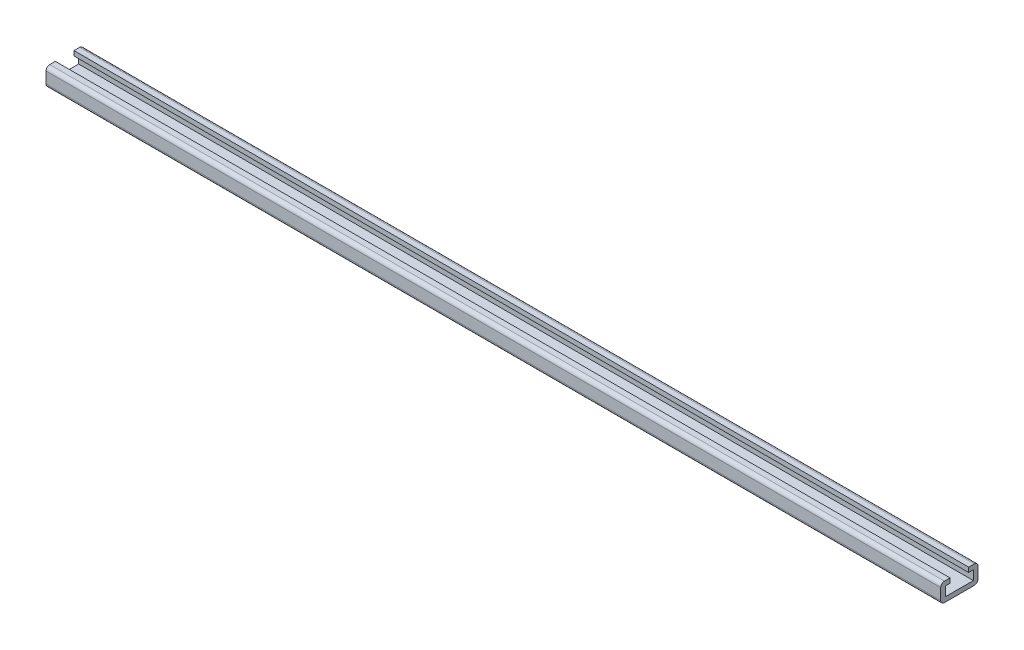
ISO-10303-21;
HEADER;
FILE_DESCRIPTION(('STEP AP214'),'2;1');
FILE_NAME('part.step','',(''),(''),'','','');
FILE_SCHEMA(('AUTOMOTIVE_DESIGN { 1 0 10303 214 1 1 1 1 }'));
ENDSEC;
DATA;
#1=APPLICATION_CONTEXT('core data for automotive mechanical design processes');
#2=APPLICATION_PROTOCOL_DEFINITION('international standard','automotive_design',2000,#1);
#3=PRODUCT_CONTEXT('',#1,'mechanical');
#4=PRODUCT('Part','Part','',(#3));
#5=PRODUCT_RELATED_PRODUCT_CATEGORY('part','',(#4));
#6=PRODUCT_DEFINITION_FORMATION('','',#4);
#7=PRODUCT_DEFINITION_CONTEXT('part definition',#1,'design');
#8=PRODUCT_DEFINITION('design','',#6,#7);
#9=PRODUCT_DEFINITION_SHAPE('','',#8);
#10=(LENGTH_UNIT() NAMED_UNIT(*) SI_UNIT(.MILLI.,.METRE.));
#11=(NAMED_UNIT(*) PLANE_ANGLE_UNIT() SI_UNIT($,.RADIAN.));
#12=(NAMED_UNIT(*) SI_UNIT($,.STERADIAN.) SOLID_ANGLE_UNIT());
#13=UNCERTAINTY_MEASURE_WITH_UNIT(LENGTH_MEASURE(1.E-05),#10,'distance_accuracy_value','');
#14=(GEOMETRIC_REPRESENTATION_CONTEXT(3) GLOBAL_UNCERTAINTY_ASSIGNED_CONTEXT((#13)) GLOBAL_UNIT_ASSIGNED_CONTEXT((#10,
#11,#12)) REPRESENTATION_CONTEXT('',''));
#15=CARTESIAN_POINT('',(0.,0.,0.));
#16=DIRECTION('',(0.,0.,1.));
#17=DIRECTION('',(1.,0.,0.));
#18=AXIS2_PLACEMENT_3D('',#15,#16,#17);
#19=CARTESIAN_POINT('',(609.6,3.175,9.525));
#20=DIRECTION('',(0.,-1.,0.));
#21=DIRECTION('',(0.,0.,-1.));
#22=AXIS2_PLACEMENT_3D('',#19,#20,#21);
#23=PLANE('',#22);
#24=CARTESIAN_POINT('',(25.4,3.175,0.));
#25=DIRECTION('',(0.,1.,0.));
#26=DIRECTION('',(0.,0.,1.));
#27=AXIS2_PLACEMENT_3D('',#24,#25,#26);
#28=CIRCLE('',#27,3.2639);
#29=CARTESIAN_POINT('',(25.4,3.175,3.2639));
#30=VERTEX_POINT('',#29);
#31=EDGE_CURVE('E388',#30,#30,#28,.T.);
#32=ORIENTED_EDGE('',*,*,#31,.F.);
#33=EDGE_LOOP('',(#32));
#34=FACE_BOUND('',#33,.T.);
#35=CARTESIAN_POINT('',(533.4,3.175,0.));
#36=DIRECTION('',(0.,1.,0.));
#37=DIRECTION('',(0.,0.,1.));
#38=AXIS2_PLACEMENT_3D('',#35,#36,#37);
#39=CIRCLE('',#38,3.26389999999999);
#40=CARTESIAN_POINT('',(533.4,3.175,3.26389999999999));
#41=VERTEX_POINT('',#40);
#42=EDGE_CURVE('E380',#41,#41,#39,.T.);
#43=ORIENTED_EDGE('',*,*,#42,.F.);
#44=EDGE_LOOP('',(#43));
#45=FACE_BOUND('',#44,.T.);
#46=DIRECTION('',(0.,0.,1.));
#47=VECTOR('',#46,1.);
#48=CARTESIAN_POINT('',(0.,3.175,9.525));
#49=LINE('',#48,#47);
#50=CARTESIAN_POINT('',(0.,3.175,-9.525));
#51=VERTEX_POINT('',#50);
#52=CARTESIAN_POINT('',(0.,3.175,9.525));
#53=VERTEX_POINT('',#52);
#54=EDGE_CURVE('E165',#51,#53,#49,.T.);
#55=ORIENTED_EDGE('',*,*,#54,.T.);
#56=DIRECTION('',(-1.,0.,0.));
#57=VECTOR('',#56,1.);
#58=CARTESIAN_POINT('',(609.6,3.175,9.525));
#59=LINE('',#58,#57);
#60=CARTESIAN_POINT('',(609.6,3.175,9.525));
#61=VERTEX_POINT('',#60);
#62=EDGE_CURVE('E272',#61,#53,#59,.T.);
#63=ORIENTED_EDGE('',*,*,#62,.F.);
#64=DIRECTION('',(0.,0.,1.));
#65=VECTOR('',#64,1.);
#66=CARTESIAN_POINT('',(609.6,3.175,9.525));
#67=LINE('',#66,#65);
#68=CARTESIAN_POINT('',(609.6,3.175,-9.525));
#69=VERTEX_POINT('',#68);
#70=EDGE_CURVE('E216',#69,#61,#67,.T.);
#71=ORIENTED_EDGE('',*,*,#70,.F.);
#72=DIRECTION('',(-1.,0.,0.));
#73=VECTOR('',#72,1.);
#74=CARTESIAN_POINT('',(609.6,3.175,-9.525));
#75=LINE('',#74,#73);
#76=EDGE_CURVE('E189',#69,#51,#75,.T.);
#77=ORIENTED_EDGE('',*,*,#76,.T.);
#78=EDGE_LOOP('',(#55,#63,#71,#77));
#79=FACE_BOUND('',#78,.T.);
#80=ADVANCED_FACE('F38',(#34,#45,#79),#23,.F.);
#81=CARTESIAN_POINT('',(609.6,9.525,9.525));
#82=DIRECTION('',(0.,0.,1.));
#83=DIRECTION('',(1.,0.,0.));
#84=AXIS2_PLACEMENT_3D('',#81,#82,#83);
#85=PLANE('',#84);
#86=DIRECTION('',(0.,1.,0.));
#87=VECTOR('',#86,1.);
#88=CARTESIAN_POINT('',(0.,9.525,9.525));
#89=LINE('',#88,#87);
#90=CARTESIAN_POINT('',(0.,9.525,9.525));
#91=VERTEX_POINT('',#90);
#92=EDGE_CURVE('E242',#53,#91,#89,.T.);
#93=ORIENTED_EDGE('',*,*,#92,.T.);
#94=DIRECTION('',(-1.,0.,0.));
#95=VECTOR('',#94,1.);
#96=CARTESIAN_POINT('',(609.6,9.525,9.525));
#97=LINE('',#96,#95);
#98=CARTESIAN_POINT('',(609.6,9.525,9.525));
#99=VERTEX_POINT('',#98);
#100=EDGE_CURVE('E268',#99,#91,#97,.T.);
#101=ORIENTED_EDGE('',*,*,#100,.F.);
#102=DIRECTION('',(0.,1.,0.));
#103=VECTOR('',#102,1.);
#104=CARTESIAN_POINT('',(609.6,9.525,9.525));
#105=LINE('',#104,#103);
#106=EDGE_CURVE('E219',#61,#99,#105,.T.);
#107=ORIENTED_EDGE('',*,*,#106,.F.);
#108=ORIENTED_EDGE('',*,*,#62,.T.);
#109=EDGE_LOOP('',(#93,#101,#107,#108));
#110=FACE_BOUND('',#109,.T.);
#111=ADVANCED_FACE('F340',(#110),#85,.F.);
#112=CARTESIAN_POINT('',(609.6,9.525,6.35));
#113=DIRECTION('',(0.,1.,0.));
#114=DIRECTION('',(0.,0.,1.));
#115=AXIS2_PLACEMENT_3D('',#112,#113,#114);
#116=PLANE('',#115);
#117=DIRECTION('',(0.,0.,-1.));
#118=VECTOR('',#117,1.);
#119=CARTESIAN_POINT('',(0.,9.525,6.35));
#120=LINE('',#119,#118);
#121=CARTESIAN_POINT('',(0.,9.525,6.35));
#122=VERTEX_POINT('',#121);
#123=EDGE_CURVE('E245',#91,#122,#120,.T.);
#124=ORIENTED_EDGE('',*,*,#123,.T.);
#125=DIRECTION('',(-1.,0.,0.));
#126=VECTOR('',#125,1.);
#127=CARTESIAN_POINT('',(609.6,9.525,6.35));
#128=LINE('',#127,#126);
#129=CARTESIAN_POINT('',(609.6,9.525,6.35));
#130=VERTEX_POINT('',#129);
#131=EDGE_CURVE('E264',#130,#122,#128,.T.);
#132=ORIENTED_EDGE('',*,*,#131,.F.);
#133=DIRECTION('',(0.,0.,-1.));
#134=VECTOR('',#133,1.);
#135=CARTESIAN_POINT('',(609.6,9.525,6.35));
#136=LINE('',#135,#134);
#137=EDGE_CURVE('E223',#99,#130,#136,.T.);
#138=ORIENTED_EDGE('',*,*,#137,.F.);
#139=ORIENTED_EDGE('',*,*,#100,.T.);
#140=EDGE_LOOP('',(#124,#132,#138,#139));
#141=FACE_BOUND('',#140,.T.);
#142=ADVANCED_FACE('F344',(#141),#116,.F.);
#143=CARTESIAN_POINT('',(609.6,12.7,6.35));
#144=DIRECTION('',(0.,0.,1.));
#145=DIRECTION('',(1.,0.,0.));
#146=AXIS2_PLACEMENT_3D('',#143,#144,#145);
#147=PLANE('',#146);
#148=DIRECTION('',(0.,1.,0.));
#149=VECTOR('',#148,1.);
#150=CARTESIAN_POINT('',(0.,12.7,6.35));
#151=LINE('',#150,#149);
#152=CARTESIAN_POINT('',(0.,12.7,6.35));
#153=VERTEX_POINT('',#152);
#154=EDGE_CURVE('E248',#122,#153,#151,.T.);
#155=ORIENTED_EDGE('',*,*,#154,.T.);
#156=DIRECTION('',(-1.,0.,0.));
#157=VECTOR('',#156,1.);
#158=CARTESIAN_POINT('',(609.6,12.7,6.35));
#159=LINE('',#158,#157);
#160=CARTESIAN_POINT('',(609.6,12.7,6.35));
#161=VERTEX_POINT('',#160);
#162=EDGE_CURVE('E239',#161,#153,#159,.T.);
#163=ORIENTED_EDGE('',*,*,#162,.F.);
#164=DIRECTION('',(0.,1.,0.));
#165=VECTOR('',#164,1.);
#166=CARTESIAN_POINT('',(609.6,12.7,6.35));
#167=LINE('',#166,#165);
#168=EDGE_CURVE('E226',#130,#161,#167,.T.);
#169=ORIENTED_EDGE('',*,*,#168,.F.);
#170=ORIENTED_EDGE('',*,*,#131,.T.);
#171=EDGE_LOOP('',(#155,#163,#169,#170));
#172=FACE_BOUND('',#171,.T.);
#173=ADVANCED_FACE('F349',(#172),#147,.F.);
#174=CARTESIAN_POINT('',(609.6,12.7,12.7));
#175=DIRECTION('',(0.,-1.,0.));
#176=DIRECTION('',(0.,0.,-1.));
#177=AXIS2_PLACEMENT_3D('',#174,#175,#176);
#178=PLANE('',#177);
#179=DIRECTION('',(0.,0.,1.));
#180=VECTOR('',#179,1.);
#181=CARTESIAN_POINT('',(0.,12.7,12.7));
#182=LINE('',#181,#180);
#183=CARTESIAN_POINT('',(0.,12.7,10.16));
#184=VERTEX_POINT('',#183);
#185=EDGE_CURVE('E251',#153,#184,#182,.T.);
#186=ORIENTED_EDGE('',*,*,#185,.T.);
#187=DIRECTION('',(-1.,0.,0.));
#188=VECTOR('',#187,1.);
#189=CARTESIAN_POINT('',(609.6,12.7,10.16));
#190=LINE('',#189,#188);
#191=CARTESIAN_POINT('',(609.6,12.7,10.16));
#192=VERTEX_POINT('',#191);
#193=EDGE_CURVE('E11',#184,#192,#190,.F.);
#194=ORIENTED_EDGE('',*,*,#193,.T.);
#195=DIRECTION('',(0.,0.,1.));
#196=VECTOR('',#195,1.);
#197=CARTESIAN_POINT('',(609.6,12.7,12.7));
#198=LINE('',#197,#196);
#199=EDGE_CURVE('E229',#161,#192,#198,.T.);
#200=ORIENTED_EDGE('',*,*,#199,.F.);
#201=ORIENTED_EDGE('',*,*,#162,.T.);
#202=EDGE_LOOP('',(#186,#194,#200,#201));
#203=FACE_BOUND('',#202,.T.);
#204=ADVANCED_FACE('F416',(#203),#178,.F.);
#205=CARTESIAN_POINT('',(609.6,0.,12.7));
#206=DIRECTION('',(0.,0.,-1.));
#207=DIRECTION('',(-1.,0.,0.));
#208=AXIS2_PLACEMENT_3D('',#205,#206,#207);
#209=PLANE('',#208);
#210=DIRECTION('',(0.,-1.,0.));
#211=VECTOR('',#210,1.);
#212=CARTESIAN_POINT('',(0.,0.,12.7));
#213=LINE('',#212,#211);
#214=CARTESIAN_POINT('',(0.,10.16,12.7));
#215=VERTEX_POINT('',#214);
#216=CARTESIAN_POINT('',(0.,2.54,12.7));
#217=VERTEX_POINT('',#216);
#218=EDGE_CURVE('E254',#215,#217,#213,.T.);
#219=ORIENTED_EDGE('',*,*,#218,.T.);
#220=DIRECTION('',(-1.,0.,0.));
#221=VECTOR('',#220,1.);
#222=CARTESIAN_POINT('',(609.6,2.54,12.7));
#223=LINE('',#222,#221);
#224=CARTESIAN_POINT('',(609.6,2.54,12.7));
#225=VERTEX_POINT('',#224);
#226=EDGE_CURVE('E299',#217,#225,#223,.F.);
#227=ORIENTED_EDGE('',*,*,#226,.T.);
#228=DIRECTION('',(0.,-1.,0.));
#229=VECTOR('',#228,1.);
#230=CARTESIAN_POINT('',(609.6,0.,12.7));
#231=LINE('',#230,#229);
#232=CARTESIAN_POINT('',(609.6,10.16,12.7));
#233=VERTEX_POINT('',#232);
#234=EDGE_CURVE('E232',#233,#225,#231,.T.);
#235=ORIENTED_EDGE('',*,*,#234,.F.);
#236=DIRECTION('',(-1.,0.,0.));
#237=VECTOR('',#236,1.);
#238=CARTESIAN_POINT('',(609.6,10.16,12.7));
#239=LINE('',#238,#237);
#240=EDGE_CURVE('E295',#233,#215,#239,.T.);
#241=ORIENTED_EDGE('',*,*,#240,.T.);
#242=EDGE_LOOP('',(#219,#227,#235,#241));
#243=FACE_BOUND('',#242,.T.);
#244=ADVANCED_FACE('F356',(#243),#209,.F.);
#245=CARTESIAN_POINT('',(609.6,0.,0.));
#246=DIRECTION('',(0.,1.,0.));
#247=DIRECTION('',(0.,0.,1.));
#248=AXIS2_PLACEMENT_3D('',#245,#246,#247);
#249=PLANE('',#248);
#250=CARTESIAN_POINT('',(25.4,0.,0.));
#251=DIRECTION('',(0.,1.,0.));
#252=DIRECTION('',(0.,0.,1.));
#253=AXIS2_PLACEMENT_3D('',#250,#251,#252);
#254=CIRCLE('',#253,3.2639);
#255=CARTESIAN_POINT('',(25.4,0.,3.2639));
#256=VERTEX_POINT('',#255);
#257=EDGE_CURVE('E384',#256,#256,#254,.T.);
#258=ORIENTED_EDGE('',*,*,#257,.T.);
#259=EDGE_LOOP('',(#258));
#260=FACE_BOUND('',#259,.T.);
#261=CARTESIAN_POINT('',(533.4,0.,0.));
#262=DIRECTION('',(0.,1.,0.));
#263=DIRECTION('',(0.,0.,1.));
#264=AXIS2_PLACEMENT_3D('',#261,#262,#263);
#265=CIRCLE('',#264,3.26389999999999);
#266=CARTESIAN_POINT('',(533.4,0.,3.26389999999999));
#267=VERTEX_POINT('',#266);
#268=EDGE_CURVE('E194',#267,#267,#265,.T.);
#269=ORIENTED_EDGE('',*,*,#268,.T.);
#270=EDGE_LOOP('',(#269));
#271=FACE_BOUND('',#270,.T.);
#272=DIRECTION('',(0.,0.,-1.));
#273=VECTOR('',#272,1.);
#274=CARTESIAN_POINT('',(609.6,0.,0.));
#275=LINE('',#274,#273);
#276=CARTESIAN_POINT('',(609.6,0.,10.16));
#277=VERTEX_POINT('',#276);
#278=CARTESIAN_POINT('',(609.6,0.,-10.16));
#279=VERTEX_POINT('',#278);
#280=EDGE_CURVE('E235',#277,#279,#275,.T.);
#281=ORIENTED_EDGE('',*,*,#280,.F.);
#282=DIRECTION('',(-1.,0.,0.));
#283=VECTOR('',#282,1.);
#284=CARTESIAN_POINT('',(609.6,0.,10.16));
#285=LINE('',#284,#283);
#286=CARTESIAN_POINT('',(0.,0.,10.16));
#287=VERTEX_POINT('',#286);
#288=EDGE_CURVE('E279',#277,#287,#285,.T.);
#289=ORIENTED_EDGE('',*,*,#288,.T.);
#290=DIRECTION('',(0.,0.,-1.));
#291=VECTOR('',#290,1.);
#292=CARTESIAN_POINT('',(0.,0.,0.));
#293=LINE('',#292,#291);
#294=CARTESIAN_POINT('',(0.,0.,-10.16));
#295=VERTEX_POINT('',#294);
#296=EDGE_CURVE('E220',#287,#295,#293,.T.);
#297=ORIENTED_EDGE('',*,*,#296,.T.);
#298=DIRECTION('',(-1.,0.,0.));
#299=VECTOR('',#298,1.);
#300=CARTESIAN_POINT('',(609.6,0.,-10.16));
#301=LINE('',#300,#299);
#302=EDGE_CURVE('E276',#295,#279,#301,.F.);
#303=ORIENTED_EDGE('',*,*,#302,.T.);
#304=EDGE_LOOP('',(#281,#289,#297,#303));
#305=FACE_BOUND('',#304,.T.);
#306=ADVANCED_FACE('F365',(#260,#271,#305),#249,.F.);
#307=CARTESIAN_POINT('',(609.6,0.,0.));
#308=DIRECTION('',(-1.,0.,0.));
#309=DIRECTION('',(0.,0.,1.));
#310=AXIS2_PLACEMENT_3D('',#307,#308,#309);
#311=PLANE('',#310);
#312=ORIENTED_EDGE('',*,*,#234,.T.);
#313=CARTESIAN_POINT('',(609.6,2.54,10.16));
#314=DIRECTION('',(-1.,0.,0.));
#315=DIRECTION('',(0.,0.,1.));
#316=AXIS2_PLACEMENT_3D('',#313,#314,#315);
#317=CIRCLE('',#316,2.54);
#318=EDGE_CURVE('E310',#225,#277,#317,.F.);
#319=ORIENTED_EDGE('',*,*,#318,.T.);
#320=ORIENTED_EDGE('',*,*,#280,.T.);
#321=CARTESIAN_POINT('',(609.6,2.54,-10.16));
#322=DIRECTION('',(-1.,0.,0.));
#323=DIRECTION('',(0.,0.,1.));
#324=AXIS2_PLACEMENT_3D('',#321,#322,#323);
#325=CIRCLE('',#324,2.54);
#326=CARTESIAN_POINT('',(609.6,2.54,-12.7));
#327=VERTEX_POINT('',#326);
#328=EDGE_CURVE('E307',#279,#327,#325,.F.);
#329=ORIENTED_EDGE('',*,*,#328,.T.);
#330=DIRECTION('',(0.,-1.,0.));
#331=VECTOR('',#330,1.);
#332=CARTESIAN_POINT('',(609.6,0.,-12.7));
#333=LINE('',#332,#331);
#334=CARTESIAN_POINT('',(609.6,10.16,-12.7));
#335=VERTEX_POINT('',#334);
#336=EDGE_CURVE('E175',#335,#327,#333,.T.);
#337=ORIENTED_EDGE('',*,*,#336,.F.);
#338=CARTESIAN_POINT('',(609.6,10.16,-10.16));
#339=DIRECTION('',(-1.,0.,0.));
#340=DIRECTION('',(0.,0.,1.));
#341=AXIS2_PLACEMENT_3D('',#338,#339,#340);
#342=CIRCLE('',#341,2.54);
#343=CARTESIAN_POINT('',(609.6,12.7,-10.16));
#344=VERTEX_POINT('',#343);
#345=EDGE_CURVE('E60',#335,#344,#342,.F.);
#346=ORIENTED_EDGE('',*,*,#345,.T.);
#347=DIRECTION('',(0.,0.,-1.));
#348=VECTOR('',#347,1.);
#349=CARTESIAN_POINT('',(609.6,12.7,-12.7));
#350=LINE('',#349,#348);
#351=CARTESIAN_POINT('',(609.6,12.7,-6.35));
#352=VERTEX_POINT('',#351);
#353=EDGE_CURVE('E156',#352,#344,#350,.T.);
#354=ORIENTED_EDGE('',*,*,#353,.F.);
#355=DIRECTION('',(0.,1.,0.));
#356=VECTOR('',#355,1.);
#357=CARTESIAN_POINT('',(609.6,12.7,-6.35));
#358=LINE('',#357,#356);
#359=CARTESIAN_POINT('',(609.6,9.525,-6.35));
#360=VERTEX_POINT('',#359);
#361=EDGE_CURVE('E172',#360,#352,#358,.T.);
#362=ORIENTED_EDGE('',*,*,#361,.F.);
#363=DIRECTION('',(0.,0.,1.));
#364=VECTOR('',#363,1.);
#365=CARTESIAN_POINT('',(609.6,9.525,-6.35));
#366=LINE('',#365,#364);
#367=CARTESIAN_POINT('',(609.6,9.525,-9.525));
#368=VERTEX_POINT('',#367);
#369=EDGE_CURVE('E179',#368,#360,#366,.T.);
#370=ORIENTED_EDGE('',*,*,#369,.F.);
#371=DIRECTION('',(0.,1.,0.));
#372=VECTOR('',#371,1.);
#373=CARTESIAN_POINT('',(609.6,9.525,-9.525));
#374=LINE('',#373,#372);
#375=EDGE_CURVE('E182',#69,#368,#374,.T.);
#376=ORIENTED_EDGE('',*,*,#375,.F.);
#377=ORIENTED_EDGE('',*,*,#70,.T.);
#378=ORIENTED_EDGE('',*,*,#106,.T.);
#379=ORIENTED_EDGE('',*,*,#137,.T.);
#380=ORIENTED_EDGE('',*,*,#168,.T.);
#381=ORIENTED_EDGE('',*,*,#199,.T.);
#382=CARTESIAN_POINT('',(609.6,10.16,10.16));
#383=DIRECTION('',(-1.,0.,0.));
#384=DIRECTION('',(0.,0.,1.));
#385=AXIS2_PLACEMENT_3D('',#382,#383,#384);
#386=CIRCLE('',#385,2.54);
#387=EDGE_CURVE('E302',#192,#233,#386,.F.);
#388=ORIENTED_EDGE('',*,*,#387,.T.);
#389=EDGE_LOOP('',(#312,#319,#320,#329,#337,#346,#354,#362,#370,#376,#377,#378,#379,#380,#381,#388));
#390=FACE_BOUND('',#389,.T.);
#391=ADVANCED_FACE('F170',(#390),#311,.F.);
#392=CARTESIAN_POINT('',(0.,0.,0.));
#393=DIRECTION('',(-1.,0.,0.));
#394=DIRECTION('',(0.,0.,1.));
#395=AXIS2_PLACEMENT_3D('',#392,#393,#394);
#396=PLANE('',#395);
#397=ORIENTED_EDGE('',*,*,#296,.F.);
#398=CARTESIAN_POINT('',(0.,2.54,10.16));
#399=DIRECTION('',(-1.,0.,0.));
#400=DIRECTION('',(0.,0.,1.));
#401=AXIS2_PLACEMENT_3D('',#398,#399,#400);
#402=CIRCLE('',#401,2.54);
#403=EDGE_CURVE('E292',#287,#217,#402,.T.);
#404=ORIENTED_EDGE('',*,*,#403,.T.);
#405=ORIENTED_EDGE('',*,*,#218,.F.);
#406=CARTESIAN_POINT('',(0.,10.16,10.16));
#407=DIRECTION('',(-1.,0.,0.));
#408=DIRECTION('',(0.,0.,1.));
#409=AXIS2_PLACEMENT_3D('',#406,#407,#408);
#410=CIRCLE('',#409,2.54);
#411=EDGE_CURVE('E283',#215,#184,#410,.T.);
#412=ORIENTED_EDGE('',*,*,#411,.T.);
#413=ORIENTED_EDGE('',*,*,#185,.F.);
#414=ORIENTED_EDGE('',*,*,#154,.F.);
#415=ORIENTED_EDGE('',*,*,#123,.F.);
#416=ORIENTED_EDGE('',*,*,#92,.F.);
#417=ORIENTED_EDGE('',*,*,#54,.F.);
#418=DIRECTION('',(0.,1.,0.));
#419=VECTOR('',#418,1.);
#420=CARTESIAN_POINT('',(0.,9.525,-9.525));
#421=LINE('',#420,#419);
#422=CARTESIAN_POINT('',(0.,9.525,-9.525));
#423=VERTEX_POINT('',#422);
#424=EDGE_CURVE('E204',#51,#423,#421,.T.);
#425=ORIENTED_EDGE('',*,*,#424,.T.);
#426=DIRECTION('',(0.,0.,1.));
#427=VECTOR('',#426,1.);
#428=CARTESIAN_POINT('',(0.,9.525,-6.35));
#429=LINE('',#428,#427);
#430=CARTESIAN_POINT('',(0.,9.525,-6.35));
#431=VERTEX_POINT('',#430);
#432=EDGE_CURVE('E200',#423,#431,#429,.T.);
#433=ORIENTED_EDGE('',*,*,#432,.T.);
#434=DIRECTION('',(0.,1.,0.));
#435=VECTOR('',#434,1.);
#436=CARTESIAN_POINT('',(0.,12.7,-6.35));
#437=LINE('',#436,#435);
#438=CARTESIAN_POINT('',(0.,12.7,-6.35));
#439=VERTEX_POINT('',#438);
#440=EDGE_CURVE('E197',#431,#439,#437,.T.);
#441=ORIENTED_EDGE('',*,*,#440,.T.);
#442=DIRECTION('',(0.,0.,-1.));
#443=VECTOR('',#442,1.);
#444=CARTESIAN_POINT('',(0.,12.7,-12.7));
#445=LINE('',#444,#443);
#446=CARTESIAN_POINT('',(0.,12.7,-10.16));
#447=VERTEX_POINT('',#446);
#448=EDGE_CURVE('E159',#439,#447,#445,.T.);
#449=ORIENTED_EDGE('',*,*,#448,.T.);
#450=CARTESIAN_POINT('',(0.,10.16,-10.16));
#451=DIRECTION('',(-1.,0.,0.));
#452=DIRECTION('',(0.,0.,1.));
#453=AXIS2_PLACEMENT_3D('',#450,#451,#452);
#454=CIRCLE('',#453,2.54);
#455=CARTESIAN_POINT('',(0.,10.16,-12.7));
#456=VERTEX_POINT('',#455);
#457=EDGE_CURVE('E286',#447,#456,#454,.T.);
#458=ORIENTED_EDGE('',*,*,#457,.T.);
#459=DIRECTION('',(0.,-1.,0.));
#460=VECTOR('',#459,1.);
#461=CARTESIAN_POINT('',(0.,0.,-12.7));
#462=LINE('',#461,#460);
#463=CARTESIAN_POINT('',(0.,2.54,-12.7));
#464=VERTEX_POINT('',#463);
#465=EDGE_CURVE('E190',#456,#464,#462,.T.);
#466=ORIENTED_EDGE('',*,*,#465,.T.);
#467=CARTESIAN_POINT('',(0.,2.54,-10.16));
#468=DIRECTION('',(-1.,0.,0.));
#469=DIRECTION('',(0.,0.,1.));
#470=AXIS2_PLACEMENT_3D('',#467,#468,#469);
#471=CIRCLE('',#470,2.54);
#472=EDGE_CURVE('E289',#464,#295,#471,.T.);
#473=ORIENTED_EDGE('',*,*,#472,.T.);
#474=EDGE_LOOP('',(#397,#404,#405,#412,#413,#414,#415,#416,#417,#425,#433,#441,#449,#458,#466,#473));
#475=FACE_BOUND('',#474,.T.);
#476=ADVANCED_FACE('F323',(#475),#396,.T.);
#477=CARTESIAN_POINT('',(609.6,0.,-12.7));
#478=DIRECTION('',(0.,0.,-1.));
#479=DIRECTION('',(0.,1.,0.));
#480=AXIS2_PLACEMENT_3D('',#477,#478,#479);
#481=PLANE('',#480);
#482=ORIENTED_EDGE('',*,*,#336,.T.);
#483=DIRECTION('',(-1.,0.,0.));
#484=VECTOR('',#483,1.);
#485=CARTESIAN_POINT('',(0.,2.54,-12.7));
#486=LINE('',#485,#484);
#487=EDGE_CURVE('E316',#327,#464,#486,.T.);
#488=ORIENTED_EDGE('',*,*,#487,.T.);
#489=ORIENTED_EDGE('',*,*,#465,.F.);
#490=DIRECTION('',(-1.,0.,0.));
#491=VECTOR('',#490,1.);
#492=CARTESIAN_POINT('',(609.6,10.16,-12.7));
#493=LINE('',#492,#491);
#494=EDGE_CURVE('E313',#456,#335,#493,.F.);
#495=ORIENTED_EDGE('',*,*,#494,.T.);
#496=EDGE_LOOP('',(#482,#488,#489,#495));
#497=FACE_BOUND('',#496,.T.);
#498=ADVANCED_FACE('F373',(#497),#481,.T.);
#499=CARTESIAN_POINT('',(609.6,12.7,-12.7));
#500=DIRECTION('',(0.,1.,0.));
#501=DIRECTION('',(0.,0.,1.));
#502=AXIS2_PLACEMENT_3D('',#499,#500,#501);
#503=PLANE('',#502);
#504=ORIENTED_EDGE('',*,*,#353,.T.);
#505=DIRECTION('',(-1.,0.,0.));
#506=VECTOR('',#505,1.);
#507=CARTESIAN_POINT('',(609.6,12.7,-10.16));
#508=LINE('',#507,#506);
#509=EDGE_CURVE('E47',#344,#447,#508,.T.);
#510=ORIENTED_EDGE('',*,*,#509,.T.);
#511=ORIENTED_EDGE('',*,*,#448,.F.);
#512=DIRECTION('',(-1.,0.,0.));
#513=VECTOR('',#512,1.);
#514=CARTESIAN_POINT('',(609.6,12.7,-6.35));
#515=LINE('',#514,#513);
#516=EDGE_CURVE('E153',#352,#439,#515,.T.);
#517=ORIENTED_EDGE('',*,*,#516,.F.);
#518=EDGE_LOOP('',(#504,#510,#511,#517));
#519=FACE_BOUND('',#518,.T.);
#520=ADVANCED_FACE('F154',(#519),#503,.T.);
#521=CARTESIAN_POINT('',(609.6,12.7,-6.35));
#522=DIRECTION('',(0.,0.,1.));
#523=DIRECTION('',(0.,-1.,0.));
#524=AXIS2_PLACEMENT_3D('',#521,#522,#523);
#525=PLANE('',#524);
#526=ORIENTED_EDGE('',*,*,#440,.F.);
#527=DIRECTION('',(-1.,0.,0.));
#528=VECTOR('',#527,1.);
#529=CARTESIAN_POINT('',(609.6,9.525,-6.35));
#530=LINE('',#529,#528);
#531=EDGE_CURVE('E166',#360,#431,#530,.T.);
#532=ORIENTED_EDGE('',*,*,#531,.F.);
#533=ORIENTED_EDGE('',*,*,#361,.T.);
#534=ORIENTED_EDGE('',*,*,#516,.T.);
#535=EDGE_LOOP('',(#526,#532,#533,#534));
#536=FACE_BOUND('',#535,.T.);
#537=ADVANCED_FACE('F177',(#536),#525,.T.);
#538=CARTESIAN_POINT('',(609.6,9.525,-6.35));
#539=DIRECTION('',(0.,-1.,0.));
#540=DIRECTION('',(0.,0.,-1.));
#541=AXIS2_PLACEMENT_3D('',#538,#539,#540);
#542=PLANE('',#541);
#543=ORIENTED_EDGE('',*,*,#432,.F.);
#544=DIRECTION('',(-1.,0.,0.));
#545=VECTOR('',#544,1.);
#546=CARTESIAN_POINT('',(609.6,9.525,-9.525));
#547=LINE('',#546,#545);
#548=EDGE_CURVE('E211',#368,#423,#547,.T.);
#549=ORIENTED_EDGE('',*,*,#548,.F.);
#550=ORIENTED_EDGE('',*,*,#369,.T.);
#551=ORIENTED_EDGE('',*,*,#531,.T.);
#552=EDGE_LOOP('',(#543,#549,#550,#551));
#553=FACE_BOUND('',#552,.T.);
#554=ADVANCED_FACE('F328',(#553),#542,.T.);
#555=CARTESIAN_POINT('',(609.6,9.525,-9.525));
#556=DIRECTION('',(0.,0.,1.));
#557=DIRECTION('',(0.,-1.,0.));
#558=AXIS2_PLACEMENT_3D('',#555,#556,#557);
#559=PLANE('',#558);
#560=ORIENTED_EDGE('',*,*,#424,.F.);
#561=ORIENTED_EDGE('',*,*,#76,.F.);
#562=ORIENTED_EDGE('',*,*,#375,.T.);
#563=ORIENTED_EDGE('',*,*,#548,.T.);
#564=EDGE_LOOP('',(#560,#561,#562,#563));
#565=FACE_BOUND('',#564,.T.);
#566=ADVANCED_FACE('F332',(#565),#559,.T.);
#567=CARTESIAN_POINT('',(609.6,2.54,10.16));
#568=DIRECTION('',(-1.,0.,0.));
#569=DIRECTION('',(0.,0.,1.));
#570=AXIS2_PLACEMENT_3D('',#567,#568,#569);
#571=CYLINDRICAL_SURFACE('',#570,2.54);
#572=ORIENTED_EDGE('',*,*,#318,.F.);
#573=ORIENTED_EDGE('',*,*,#226,.F.);
#574=ORIENTED_EDGE('',*,*,#403,.F.);
#575=ORIENTED_EDGE('',*,*,#288,.F.);
#576=EDGE_LOOP('',(#572,#573,#574,#575));
#577=FACE_BOUND('',#576,.T.);
#578=ADVANCED_FACE('F362',(#577),#571,.T.);
#579=CARTESIAN_POINT('',(609.6,2.54,-10.16));
#580=DIRECTION('',(1.,0.,0.));
#581=DIRECTION('',(0.,0.,-1.));
#582=AXIS2_PLACEMENT_3D('',#579,#580,#581);
#583=CYLINDRICAL_SURFACE('',#582,2.54);
#584=ORIENTED_EDGE('',*,*,#328,.F.);
#585=ORIENTED_EDGE('',*,*,#302,.F.);
#586=ORIENTED_EDGE('',*,*,#472,.F.);
#587=ORIENTED_EDGE('',*,*,#487,.F.);
#588=EDGE_LOOP('',(#584,#585,#586,#587));
#589=FACE_BOUND('',#588,.T.);
#590=ADVANCED_FACE('F371',(#589),#583,.T.);
#591=CARTESIAN_POINT('',(609.6,10.16,-10.16));
#592=DIRECTION('',(-1.,0.,0.));
#593=DIRECTION('',(0.,0.,1.));
#594=AXIS2_PLACEMENT_3D('',#591,#592,#593);
#595=CYLINDRICAL_SURFACE('',#594,2.54);
#596=ORIENTED_EDGE('',*,*,#345,.F.);
#597=ORIENTED_EDGE('',*,*,#494,.F.);
#598=ORIENTED_EDGE('',*,*,#457,.F.);
#599=ORIENTED_EDGE('',*,*,#509,.F.);
#600=EDGE_LOOP('',(#596,#597,#598,#599));
#601=FACE_BOUND('',#600,.T.);
#602=ADVANCED_FACE('F431',(#601),#595,.T.);
#603=CARTESIAN_POINT('',(609.6,10.16,10.16));
#604=DIRECTION('',(-1.,0.,0.));
#605=DIRECTION('',(0.,0.,1.));
#606=AXIS2_PLACEMENT_3D('',#603,#604,#605);
#607=CYLINDRICAL_SURFACE('',#606,2.54);
#608=ORIENTED_EDGE('',*,*,#387,.F.);
#609=ORIENTED_EDGE('',*,*,#193,.F.);
#610=ORIENTED_EDGE('',*,*,#411,.F.);
#611=ORIENTED_EDGE('',*,*,#240,.F.);
#612=EDGE_LOOP('',(#608,#609,#610,#611));
#613=FACE_BOUND('',#612,.T.);
#614=ADVANCED_FACE('F40',(#613),#607,.T.);
#615=CARTESIAN_POINT('',(533.4,3.175,0.));
#616=DIRECTION('',(0.,1.,0.));
#617=DIRECTION('',(0.,0.,1.));
#618=AXIS2_PLACEMENT_3D('',#615,#616,#617);
#619=CYLINDRICAL_SURFACE('',#618,3.26389999999999);
#620=ORIENTED_EDGE('',*,*,#42,.T.);
#621=EDGE_LOOP('',(#620));
#622=FACE_BOUND('',#621,.T.);
#623=ORIENTED_EDGE('',*,*,#268,.F.);
#624=EDGE_LOOP('',(#623));
#625=FACE_BOUND('',#624,.T.);
#626=ADVANCED_FACE('F401',(#622,#625),#619,.F.);
#627=CARTESIAN_POINT('',(25.4,3.175,0.));
#628=DIRECTION('',(0.,1.,0.));
#629=DIRECTION('',(0.,0.,1.));
#630=AXIS2_PLACEMENT_3D('',#627,#628,#629);
#631=CYLINDRICAL_SURFACE('',#630,3.2639);
#632=ORIENTED_EDGE('',*,*,#31,.T.);
#633=EDGE_LOOP('',(#632));
#634=FACE_BOUND('',#633,.T.);
#635=ORIENTED_EDGE('',*,*,#257,.F.);
#636=EDGE_LOOP('',(#635));
#637=FACE_BOUND('',#636,.T.);
#638=ADVANCED_FACE('F393',(#634,#637),#631,.F.);
#639=CLOSED_SHELL('',(#80,#111,#142,#173,#204,#244,#306,#391,#476,#498,#520,#537,#554,#566,#578,
#590,#602,#614,#626,#638));
#640=MANIFOLD_SOLID_BREP('B2',#639);
#641=ADVANCED_BREP_SHAPE_REPRESENTATION('',(#18,#640),#14);
#642=SHAPE_DEFINITION_REPRESENTATION(#9,#641);
ENDSEC;
END-ISO-10303-21;
